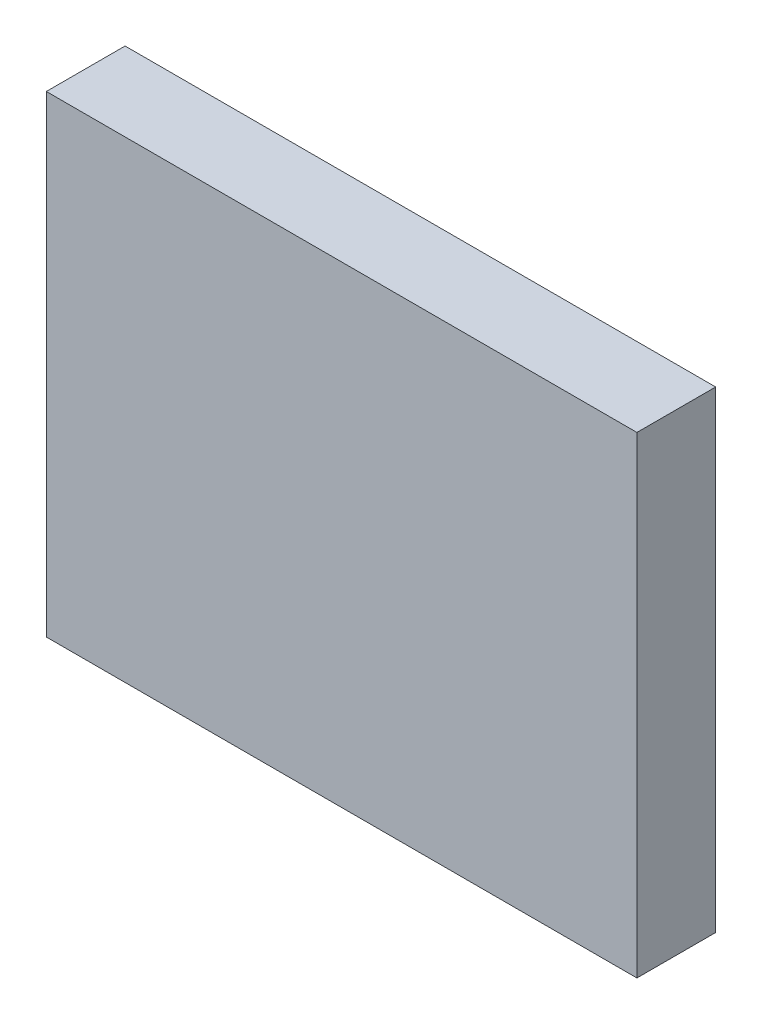
ISO-10303-21;
HEADER;
FILE_DESCRIPTION(('STEP AP214'),'2;1');
FILE_NAME('part.step','',(''),(''),'','','');
FILE_SCHEMA(('AUTOMOTIVE_DESIGN { 1 0 10303 214 1 1 1 1 }'));
ENDSEC;
DATA;
#1=APPLICATION_CONTEXT('core data for automotive mechanical design processes');
#2=APPLICATION_PROTOCOL_DEFINITION('international standard','automotive_design',2000,#1);
#3=PRODUCT_CONTEXT('',#1,'mechanical');
#4=PRODUCT('Part','Part','',(#3));
#5=PRODUCT_RELATED_PRODUCT_CATEGORY('part','',(#4));
#6=PRODUCT_DEFINITION_FORMATION('','',#4);
#7=PRODUCT_DEFINITION_CONTEXT('part definition',#1,'design');
#8=PRODUCT_DEFINITION('design','',#6,#7);
#9=PRODUCT_DEFINITION_SHAPE('','',#8);
#10=(LENGTH_UNIT() NAMED_UNIT(*) SI_UNIT(.MILLI.,.METRE.));
#11=(NAMED_UNIT(*) PLANE_ANGLE_UNIT() SI_UNIT($,.RADIAN.));
#12=(NAMED_UNIT(*) SI_UNIT($,.STERADIAN.) SOLID_ANGLE_UNIT());
#13=UNCERTAINTY_MEASURE_WITH_UNIT(LENGTH_MEASURE(1.E-05),#10,'distance_accuracy_value','');
#14=(GEOMETRIC_REPRESENTATION_CONTEXT(3) GLOBAL_UNCERTAINTY_ASSIGNED_CONTEXT((#13)) GLOBAL_UNIT_ASSIGNED_CONTEXT((#10,
#11,#12)) REPRESENTATION_CONTEXT('',''));
#15=CARTESIAN_POINT('',(0.,0.,0.));
#16=DIRECTION('',(0.,0.,1.));
#17=DIRECTION('',(1.,0.,0.));
#18=AXIS2_PLACEMENT_3D('',#15,#16,#17);
#19=CARTESIAN_POINT('',(0.,0.,0.));
#20=DIRECTION('',(0.,0.,1.));
#21=DIRECTION('',(1.,0.,0.));
#22=AXIS2_PLACEMENT_3D('',#19,#20,#21);
#23=PLANE('',#22);
#24=DIRECTION('',(0.,1.,0.));
#25=VECTOR('',#24,1.);
#26=CARTESIAN_POINT('',(-7.5,6.,0.));
#27=LINE('',#26,#25);
#28=CARTESIAN_POINT('',(-7.5,6.,0.));
#29=VERTEX_POINT('',#28);
#30=CARTESIAN_POINT('',(-7.5,-6.,0.));
#31=VERTEX_POINT('',#30);
#32=EDGE_CURVE('E77',#29,#31,#27,.F.);
#33=ORIENTED_EDGE('',*,*,#32,.F.);
#34=DIRECTION('',(1.,0.,0.));
#35=VECTOR('',#34,1.);
#36=CARTESIAN_POINT('',(7.5,6.,0.));
#37=LINE('',#36,#35);
#38=CARTESIAN_POINT('',(7.5,6.,0.));
#39=VERTEX_POINT('',#38);
#40=EDGE_CURVE('E53',#39,#29,#37,.F.);
#41=ORIENTED_EDGE('',*,*,#40,.F.);
#42=DIRECTION('',(0.,1.,0.));
#43=VECTOR('',#42,1.);
#44=CARTESIAN_POINT('',(7.5,-6.,0.));
#45=LINE('',#44,#43);
#46=CARTESIAN_POINT('',(7.5,-6.,0.));
#47=VERTEX_POINT('',#46);
#48=EDGE_CURVE('E55',#47,#39,#45,.T.);
#49=ORIENTED_EDGE('',*,*,#48,.F.);
#50=DIRECTION('',(1.,0.,0.));
#51=VECTOR('',#50,1.);
#52=CARTESIAN_POINT('',(-7.5,-6.,0.));
#53=LINE('',#52,#51);
#54=EDGE_CURVE('E18',#31,#47,#53,.T.);
#55=ORIENTED_EDGE('',*,*,#54,.F.);
#56=EDGE_LOOP('',(#33,#41,#49,#55));
#57=FACE_BOUND('',#56,.T.);
#58=ADVANCED_FACE('F15',(#57),#23,.F.);
#59=CARTESIAN_POINT('',(-7.5,-6.,0.));
#60=DIRECTION('',(0.,-1.,0.));
#61=DIRECTION('',(0.,0.,-1.));
#62=AXIS2_PLACEMENT_3D('',#59,#60,#61);
#63=PLANE('',#62);
#64=DIRECTION('',(1.,0.,0.));
#65=VECTOR('',#64,1.);
#66=CARTESIAN_POINT('',(0.,-6.,2.));
#67=LINE('',#66,#65);
#68=CARTESIAN_POINT('',(-7.5,-6.,2.));
#69=VERTEX_POINT('',#68);
#70=CARTESIAN_POINT('',(7.5,-6.,2.));
#71=VERTEX_POINT('',#70);
#72=EDGE_CURVE('E81',#69,#71,#67,.T.);
#73=ORIENTED_EDGE('',*,*,#72,.F.);
#74=DIRECTION('',(0.,0.,1.));
#75=VECTOR('',#74,1.);
#76=CARTESIAN_POINT('',(-7.5,-6.,0.));
#77=LINE('',#76,#75);
#78=EDGE_CURVE('E66',#31,#69,#77,.T.);
#79=ORIENTED_EDGE('',*,*,#78,.F.);
#80=ORIENTED_EDGE('',*,*,#54,.T.);
#81=DIRECTION('',(0.,0.,-1.));
#82=VECTOR('',#81,1.);
#83=CARTESIAN_POINT('',(7.5,-6.,0.));
#84=LINE('',#83,#82);
#85=EDGE_CURVE('E61',#71,#47,#84,.T.);
#86=ORIENTED_EDGE('',*,*,#85,.F.);
#87=EDGE_LOOP('',(#73,#79,#80,#86));
#88=FACE_BOUND('',#87,.T.);
#89=ADVANCED_FACE('F63',(#88),#63,.T.);
#90=CARTESIAN_POINT('',(7.5,-6.,0.));
#91=DIRECTION('',(1.,0.,0.));
#92=DIRECTION('',(0.,0.,-1.));
#93=AXIS2_PLACEMENT_3D('',#90,#91,#92);
#94=PLANE('',#93);
#95=DIRECTION('',(0.,1.,0.));
#96=VECTOR('',#95,1.);
#97=CARTESIAN_POINT('',(7.5,0.,2.));
#98=LINE('',#97,#96);
#99=CARTESIAN_POINT('',(7.5,6.,2.));
#100=VERTEX_POINT('',#99);
#101=EDGE_CURVE('E70',#71,#100,#98,.T.);
#102=ORIENTED_EDGE('',*,*,#101,.F.);
#103=ORIENTED_EDGE('',*,*,#85,.T.);
#104=ORIENTED_EDGE('',*,*,#48,.T.);
#105=DIRECTION('',(0.,0.,1.));
#106=VECTOR('',#105,1.);
#107=CARTESIAN_POINT('',(7.5,6.,0.));
#108=LINE('',#107,#106);
#109=EDGE_CURVE('E73',#100,#39,#108,.F.);
#110=ORIENTED_EDGE('',*,*,#109,.F.);
#111=EDGE_LOOP('',(#102,#103,#104,#110));
#112=FACE_BOUND('',#111,.T.);
#113=ADVANCED_FACE('F68',(#112),#94,.T.);
#114=CARTESIAN_POINT('',(7.5,6.,0.));
#115=DIRECTION('',(0.,1.,0.));
#116=DIRECTION('',(0.,0.,1.));
#117=AXIS2_PLACEMENT_3D('',#114,#115,#116);
#118=PLANE('',#117);
#119=DIRECTION('',(1.,0.,0.));
#120=VECTOR('',#119,1.);
#121=CARTESIAN_POINT('',(0.,6.,2.));
#122=LINE('',#121,#120);
#123=CARTESIAN_POINT('',(-7.5,6.,2.));
#124=VERTEX_POINT('',#123);
#125=EDGE_CURVE('E24',#100,#124,#122,.F.);
#126=ORIENTED_EDGE('',*,*,#125,.F.);
#127=ORIENTED_EDGE('',*,*,#109,.T.);
#128=ORIENTED_EDGE('',*,*,#40,.T.);
#129=DIRECTION('',(0.,0.,1.));
#130=VECTOR('',#129,1.);
#131=CARTESIAN_POINT('',(-7.5,6.,0.));
#132=LINE('',#131,#130);
#133=EDGE_CURVE('E33',#124,#29,#132,.F.);
#134=ORIENTED_EDGE('',*,*,#133,.F.);
#135=EDGE_LOOP('',(#126,#127,#128,#134));
#136=FACE_BOUND('',#135,.T.);
#137=ADVANCED_FACE('F87',(#136),#118,.T.);
#138=CARTESIAN_POINT('',(-7.5,6.,0.));
#139=DIRECTION('',(-1.,0.,0.));
#140=DIRECTION('',(0.,0.,1.));
#141=AXIS2_PLACEMENT_3D('',#138,#139,#140);
#142=PLANE('',#141);
#143=DIRECTION('',(0.,1.,0.));
#144=VECTOR('',#143,1.);
#145=CARTESIAN_POINT('',(-7.5,0.,2.));
#146=LINE('',#145,#144);
#147=EDGE_CURVE('E10',#124,#69,#146,.F.);
#148=ORIENTED_EDGE('',*,*,#147,.F.);
#149=ORIENTED_EDGE('',*,*,#133,.T.);
#150=ORIENTED_EDGE('',*,*,#32,.T.);
#151=ORIENTED_EDGE('',*,*,#78,.T.);
#152=EDGE_LOOP('',(#148,#149,#150,#151));
#153=FACE_BOUND('',#152,.T.);
#154=ADVANCED_FACE('F89',(#153),#142,.T.);
#155=CARTESIAN_POINT('',(0.,0.,2.));
#156=DIRECTION('',(0.,0.,1.));
#157=DIRECTION('',(1.,0.,0.));
#158=AXIS2_PLACEMENT_3D('',#155,#156,#157);
#159=PLANE('',#158);
#160=ORIENTED_EDGE('',*,*,#125,.T.);
#161=ORIENTED_EDGE('',*,*,#147,.T.);
#162=ORIENTED_EDGE('',*,*,#72,.T.);
#163=ORIENTED_EDGE('',*,*,#101,.T.);
#164=EDGE_LOOP('',(#160,#161,#162,#163));
#165=FACE_BOUND('',#164,.T.);
#166=ADVANCED_FACE('F86',(#165),#159,.T.);
#167=CLOSED_SHELL('',(#58,#89,#113,#137,#154,#166));
#168=MANIFOLD_SOLID_BREP('B1',#167);
#169=ADVANCED_BREP_SHAPE_REPRESENTATION('',(#18,#168),#14);
#170=SHAPE_DEFINITION_REPRESENTATION(#9,#169);
ENDSEC;
END-ISO-10303-21;
